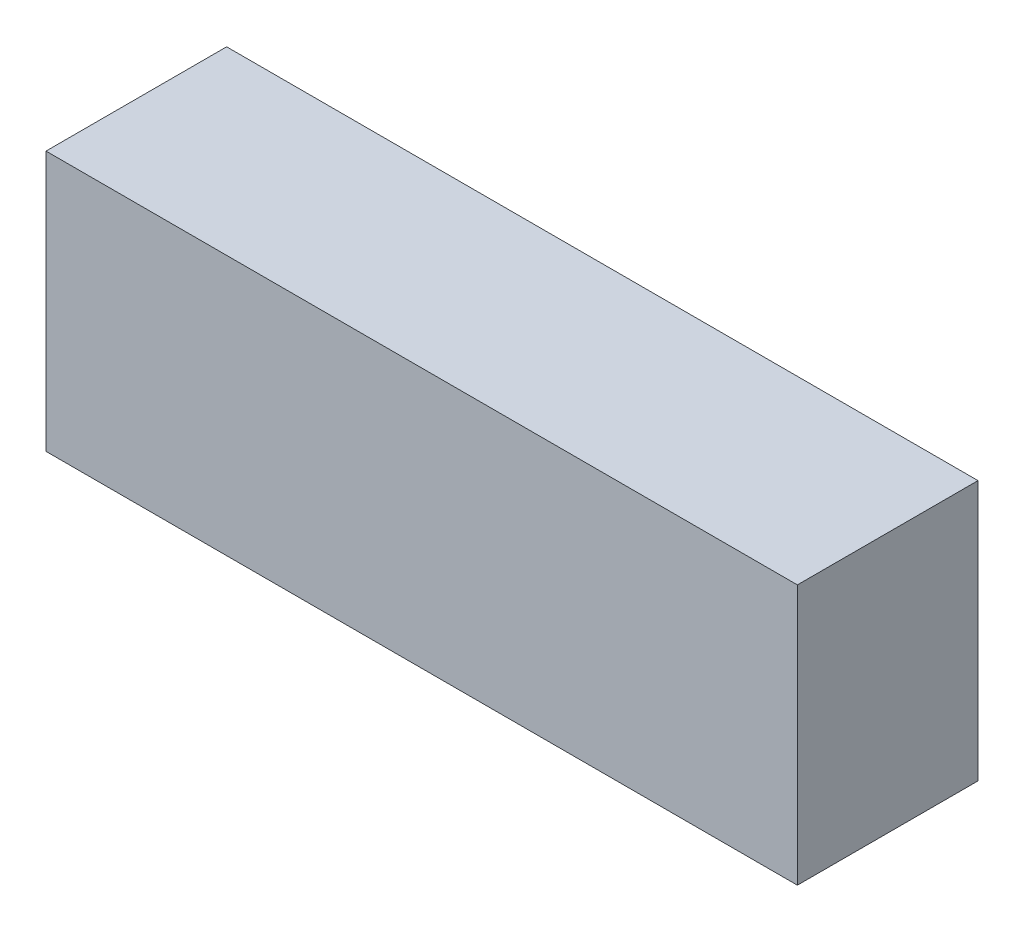
ISO-10303-21;
HEADER;
FILE_DESCRIPTION(('STEP AP214'),'2;1');
FILE_NAME('part.step','',(''),(''),'','','');
FILE_SCHEMA(('AUTOMOTIVE_DESIGN { 1 0 10303 214 1 1 1 1 }'));
ENDSEC;
DATA;
#1=APPLICATION_CONTEXT('core data for automotive mechanical design processes');
#2=APPLICATION_PROTOCOL_DEFINITION('international standard','automotive_design',2000,#1);
#3=PRODUCT_CONTEXT('',#1,'mechanical');
#4=PRODUCT('Part','Part','',(#3));
#5=PRODUCT_RELATED_PRODUCT_CATEGORY('part','',(#4));
#6=PRODUCT_DEFINITION_FORMATION('','',#4);
#7=PRODUCT_DEFINITION_CONTEXT('part definition',#1,'design');
#8=PRODUCT_DEFINITION('design','',#6,#7);
#9=PRODUCT_DEFINITION_SHAPE('','',#8);
#10=(LENGTH_UNIT() NAMED_UNIT(*) SI_UNIT(.MILLI.,.METRE.));
#11=(NAMED_UNIT(*) PLANE_ANGLE_UNIT() SI_UNIT($,.RADIAN.));
#12=(NAMED_UNIT(*) SI_UNIT($,.STERADIAN.) SOLID_ANGLE_UNIT());
#13=UNCERTAINTY_MEASURE_WITH_UNIT(LENGTH_MEASURE(1.E-05),#10,'distance_accuracy_value','');
#14=(GEOMETRIC_REPRESENTATION_CONTEXT(3) GLOBAL_UNCERTAINTY_ASSIGNED_CONTEXT((#13)) GLOBAL_UNIT_ASSIGNED_CONTEXT((#10,
#11,#12)) REPRESENTATION_CONTEXT('',''));
#15=CARTESIAN_POINT('',(0.,0.,0.));
#16=DIRECTION('',(0.,0.,1.));
#17=DIRECTION('',(1.,0.,0.));
#18=AXIS2_PLACEMENT_3D('',#15,#16,#17);
#19=CARTESIAN_POINT('',(-52.,-18.,25.));
#20=DIRECTION('',(1.,0.,0.));
#21=DIRECTION('',(0.,0.,-1.));
#22=AXIS2_PLACEMENT_3D('',#19,#20,#21);
#23=PLANE('',#22);
#24=DIRECTION('',(0.,-1.,0.));
#25=VECTOR('',#24,1.);
#26=CARTESIAN_POINT('',(-52.,-18.,0.));
#27=LINE('',#26,#25);
#28=CARTESIAN_POINT('',(-52.,18.,0.));
#29=VERTEX_POINT('',#28);
#30=CARTESIAN_POINT('',(-52.,-18.,0.));
#31=VERTEX_POINT('',#30);
#32=EDGE_CURVE('E100',#29,#31,#27,.T.);
#33=ORIENTED_EDGE('',*,*,#32,.T.);
#34=DIRECTION('',(0.,0.,-1.));
#35=VECTOR('',#34,1.);
#36=CARTESIAN_POINT('',(-52.,-18.,25.));
#37=LINE('',#36,#35);
#38=CARTESIAN_POINT('',(-52.,-18.,25.));
#39=VERTEX_POINT('',#38);
#40=EDGE_CURVE('E11',#39,#31,#37,.T.);
#41=ORIENTED_EDGE('',*,*,#40,.F.);
#42=DIRECTION('',(0.,-1.,0.));
#43=VECTOR('',#42,1.);
#44=CARTESIAN_POINT('',(-52.,-18.,25.));
#45=LINE('',#44,#43);
#46=CARTESIAN_POINT('',(-52.,18.,25.));
#47=VERTEX_POINT('',#46);
#48=EDGE_CURVE('E88',#47,#39,#45,.T.);
#49=ORIENTED_EDGE('',*,*,#48,.F.);
#50=DIRECTION('',(0.,0.,-1.));
#51=VECTOR('',#50,1.);
#52=CARTESIAN_POINT('',(-52.,18.,25.));
#53=LINE('',#52,#51);
#54=EDGE_CURVE('E96',#47,#29,#53,.T.);
#55=ORIENTED_EDGE('',*,*,#54,.T.);
#56=EDGE_LOOP('',(#33,#41,#49,#55));
#57=FACE_BOUND('',#56,.T.);
#58=ADVANCED_FACE('F37',(#57),#23,.F.);
#59=CARTESIAN_POINT('',(52.,-18.,25.));
#60=DIRECTION('',(0.,1.,0.));
#61=DIRECTION('',(-1.,0.,0.));
#62=AXIS2_PLACEMENT_3D('',#59,#60,#61);
#63=PLANE('',#62);
#64=DIRECTION('',(1.,0.,0.));
#65=VECTOR('',#64,1.);
#66=CARTESIAN_POINT('',(52.,-18.,0.));
#67=LINE('',#66,#65);
#68=CARTESIAN_POINT('',(52.,-18.,0.));
#69=VERTEX_POINT('',#68);
#70=EDGE_CURVE('E92',#31,#69,#67,.T.);
#71=ORIENTED_EDGE('',*,*,#70,.T.);
#72=DIRECTION('',(0.,0.,-1.));
#73=VECTOR('',#72,1.);
#74=CARTESIAN_POINT('',(52.,-18.,25.));
#75=LINE('',#74,#73);
#76=CARTESIAN_POINT('',(52.,-18.,25.));
#77=VERTEX_POINT('',#76);
#78=EDGE_CURVE('E45',#77,#69,#75,.T.);
#79=ORIENTED_EDGE('',*,*,#78,.F.);
#80=DIRECTION('',(1.,0.,0.));
#81=VECTOR('',#80,1.);
#82=CARTESIAN_POINT('',(52.,-18.,25.));
#83=LINE('',#82,#81);
#84=EDGE_CURVE('E83',#39,#77,#83,.T.);
#85=ORIENTED_EDGE('',*,*,#84,.F.);
#86=ORIENTED_EDGE('',*,*,#40,.T.);
#87=EDGE_LOOP('',(#71,#79,#85,#86));
#88=FACE_BOUND('',#87,.T.);
#89=ADVANCED_FACE('F91',(#88),#63,.F.);
#90=CARTESIAN_POINT('',(52.,-18.,25.));
#91=DIRECTION('',(-1.,0.,0.));
#92=DIRECTION('',(0.,0.,1.));
#93=AXIS2_PLACEMENT_3D('',#90,#91,#92);
#94=PLANE('',#93);
#95=DIRECTION('',(0.,1.,0.));
#96=VECTOR('',#95,1.);
#97=CARTESIAN_POINT('',(52.,-18.,0.));
#98=LINE('',#97,#96);
#99=CARTESIAN_POINT('',(52.,18.,0.));
#100=VERTEX_POINT('',#99);
#101=EDGE_CURVE('E70',#69,#100,#98,.T.);
#102=ORIENTED_EDGE('',*,*,#101,.T.);
#103=DIRECTION('',(0.,0.,-1.));
#104=VECTOR('',#103,1.);
#105=CARTESIAN_POINT('',(52.,18.,25.));
#106=LINE('',#105,#104);
#107=CARTESIAN_POINT('',(52.,18.,25.));
#108=VERTEX_POINT('',#107);
#109=EDGE_CURVE('E93',#108,#100,#106,.T.);
#110=ORIENTED_EDGE('',*,*,#109,.F.);
#111=DIRECTION('',(0.,1.,0.));
#112=VECTOR('',#111,1.);
#113=CARTESIAN_POINT('',(52.,-18.,25.));
#114=LINE('',#113,#112);
#115=EDGE_CURVE('E86',#77,#108,#114,.T.);
#116=ORIENTED_EDGE('',*,*,#115,.F.);
#117=ORIENTED_EDGE('',*,*,#78,.T.);
#118=EDGE_LOOP('',(#102,#110,#116,#117));
#119=FACE_BOUND('',#118,.T.);
#120=ADVANCED_FACE('F94',(#119),#94,.F.);
#121=CARTESIAN_POINT('',(52.,18.,25.));
#122=DIRECTION('',(0.,-1.,0.));
#123=DIRECTION('',(1.,0.,0.));
#124=AXIS2_PLACEMENT_3D('',#121,#122,#123);
#125=PLANE('',#124);
#126=DIRECTION('',(-1.,0.,0.));
#127=VECTOR('',#126,1.);
#128=CARTESIAN_POINT('',(52.,18.,0.));
#129=LINE('',#128,#127);
#130=EDGE_CURVE('E76',#100,#29,#129,.T.);
#131=ORIENTED_EDGE('',*,*,#130,.T.);
#132=ORIENTED_EDGE('',*,*,#54,.F.);
#133=DIRECTION('',(-1.,0.,0.));
#134=VECTOR('',#133,1.);
#135=CARTESIAN_POINT('',(52.,18.,25.));
#136=LINE('',#135,#134);
#137=EDGE_CURVE('E53',#108,#47,#136,.T.);
#138=ORIENTED_EDGE('',*,*,#137,.F.);
#139=ORIENTED_EDGE('',*,*,#109,.T.);
#140=EDGE_LOOP('',(#131,#132,#138,#139));
#141=FACE_BOUND('',#140,.T.);
#142=ADVANCED_FACE('F107',(#141),#125,.F.);
#143=CARTESIAN_POINT('',(0.,0.,25.));
#144=DIRECTION('',(0.,0.,1.));
#145=DIRECTION('',(1.,0.,0.));
#146=AXIS2_PLACEMENT_3D('',#143,#144,#145);
#147=PLANE('',#146);
#148=ORIENTED_EDGE('',*,*,#48,.T.);
#149=ORIENTED_EDGE('',*,*,#84,.T.);
#150=ORIENTED_EDGE('',*,*,#115,.T.);
#151=ORIENTED_EDGE('',*,*,#137,.T.);
#152=EDGE_LOOP('',(#148,#149,#150,#151));
#153=FACE_BOUND('',#152,.T.);
#154=ADVANCED_FACE('F84',(#153),#147,.T.);
#155=CARTESIAN_POINT('',(0.,0.,0.));
#156=DIRECTION('',(0.,0.,1.));
#157=DIRECTION('',(1.,0.,0.));
#158=AXIS2_PLACEMENT_3D('',#155,#156,#157);
#159=PLANE('',#158);
#160=ORIENTED_EDGE('',*,*,#32,.F.);
#161=ORIENTED_EDGE('',*,*,#130,.F.);
#162=ORIENTED_EDGE('',*,*,#101,.F.);
#163=ORIENTED_EDGE('',*,*,#70,.F.);
#164=EDGE_LOOP('',(#160,#161,#162,#163));
#165=FACE_BOUND('',#164,.T.);
#166=ADVANCED_FACE('F110',(#165),#159,.F.);
#167=CLOSED_SHELL('',(#58,#89,#120,#142,#154,#166));
#168=MANIFOLD_SOLID_BREP('B2',#167);
#169=ADVANCED_BREP_SHAPE_REPRESENTATION('',(#18,#168),#14);
#170=SHAPE_DEFINITION_REPRESENTATION(#9,#169);
ENDSEC;
END-ISO-10303-21;
